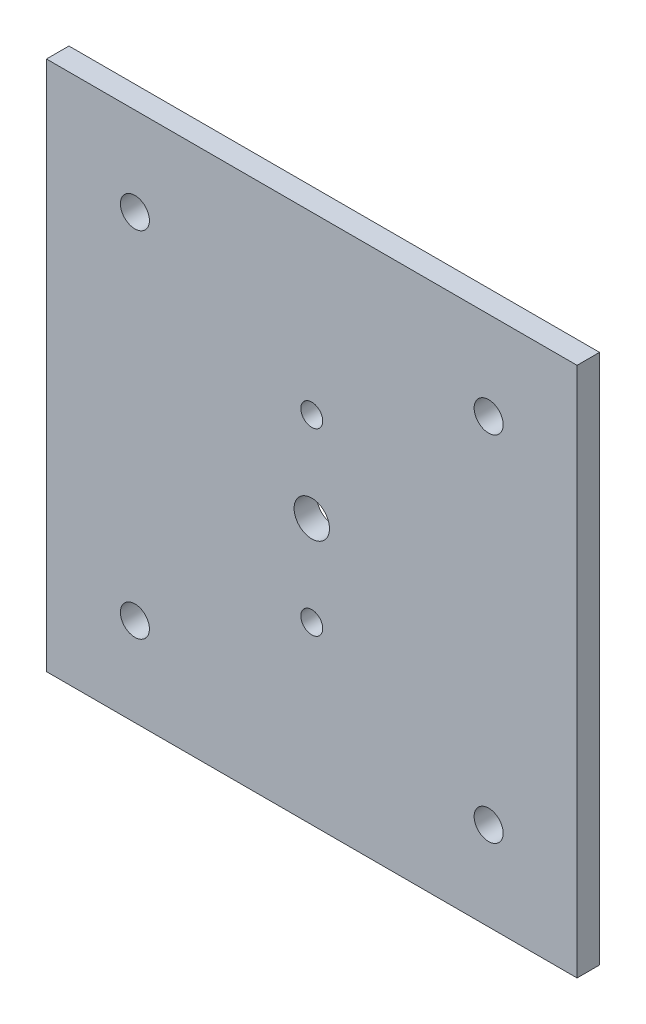
ISO-10303-21;
HEADER;
FILE_DESCRIPTION(('STEP AP214'),'2;1');
FILE_NAME('part.step','',(''),(''),'','','');
FILE_SCHEMA(('AUTOMOTIVE_DESIGN { 1 0 10303 214 1 1 1 1 }'));
ENDSEC;
DATA;
#1=APPLICATION_CONTEXT('core data for automotive mechanical design processes');
#2=APPLICATION_PROTOCOL_DEFINITION('international standard','automotive_design',2000,#1);
#3=PRODUCT_CONTEXT('',#1,'mechanical');
#4=PRODUCT('Part','Part','',(#3));
#5=PRODUCT_RELATED_PRODUCT_CATEGORY('part','',(#4));
#6=PRODUCT_DEFINITION_FORMATION('','',#4);
#7=PRODUCT_DEFINITION_CONTEXT('part definition',#1,'design');
#8=PRODUCT_DEFINITION('design','',#6,#7);
#9=PRODUCT_DEFINITION_SHAPE('','',#8);
#10=(LENGTH_UNIT() NAMED_UNIT(*) SI_UNIT(.MILLI.,.METRE.));
#11=(NAMED_UNIT(*) PLANE_ANGLE_UNIT() SI_UNIT($,.RADIAN.));
#12=(NAMED_UNIT(*) SI_UNIT($,.STERADIAN.) SOLID_ANGLE_UNIT());
#13=UNCERTAINTY_MEASURE_WITH_UNIT(LENGTH_MEASURE(1.E-05),#10,'distance_accuracy_value','');
#14=(GEOMETRIC_REPRESENTATION_CONTEXT(3) GLOBAL_UNCERTAINTY_ASSIGNED_CONTEXT((#13)) GLOBAL_UNIT_ASSIGNED_CONTEXT((#10,
#11,#12)) REPRESENTATION_CONTEXT('',''));
#15=CARTESIAN_POINT('',(0.,0.,0.));
#16=DIRECTION('',(0.,0.,1.));
#17=DIRECTION('',(1.,0.,0.));
#18=AXIS2_PLACEMENT_3D('',#15,#16,#17);
#19=CARTESIAN_POINT('',(0.,0.,6.35));
#20=DIRECTION('',(0.,0.,1.));
#21=DIRECTION('',(1.,0.,0.));
#22=AXIS2_PLACEMENT_3D('',#19,#20,#21);
#23=PLANE('',#22);
#24=CARTESIAN_POINT('',(-50.,-50.,6.35));
#25=DIRECTION('',(0.,0.,1.));
#26=DIRECTION('',(1.,0.,0.));
#27=AXIS2_PLACEMENT_3D('',#24,#25,#26);
#28=CIRCLE('',#27,4.1);
#29=CARTESIAN_POINT('',(-45.9,-50.,6.35));
#30=VERTEX_POINT('',#29);
#31=EDGE_CURVE('E141',#30,#30,#28,.T.);
#32=ORIENTED_EDGE('',*,*,#31,.F.);
#33=EDGE_LOOP('',(#32));
#34=FACE_BOUND('',#33,.T.);
#35=CARTESIAN_POINT('',(50.,50.,6.35));
#36=DIRECTION('',(0.,0.,1.));
#37=DIRECTION('',(1.,0.,0.));
#38=AXIS2_PLACEMENT_3D('',#35,#36,#37);
#39=CIRCLE('',#38,4.1);
#40=CARTESIAN_POINT('',(54.1,50.,6.35));
#41=VERTEX_POINT('',#40);
#42=EDGE_CURVE('E129',#41,#41,#39,.T.);
#43=ORIENTED_EDGE('',*,*,#42,.F.);
#44=EDGE_LOOP('',(#43));
#45=FACE_BOUND('',#44,.T.);
#46=CARTESIAN_POINT('',(0.,-25.4,6.35));
#47=DIRECTION('',(0.,0.,1.));
#48=DIRECTION('',(1.,0.,0.));
#49=AXIS2_PLACEMENT_3D('',#46,#47,#48);
#50=CIRCLE('',#49,3.1);
#51=CARTESIAN_POINT('',(3.10000000000001,-25.4,6.35));
#52=VERTEX_POINT('',#51);
#53=EDGE_CURVE('E117',#52,#52,#50,.T.);
#54=ORIENTED_EDGE('',*,*,#53,.F.);
#55=EDGE_LOOP('',(#54));
#56=FACE_BOUND('',#55,.T.);
#57=DIRECTION('',(0.,1.,0.));
#58=VECTOR('',#57,1.);
#59=CARTESIAN_POINT('',(75.,75.,6.35));
#60=LINE('',#59,#58);
#61=CARTESIAN_POINT('',(75.,-75.,6.35));
#62=VERTEX_POINT('',#61);
#63=CARTESIAN_POINT('',(75.,75.,6.35));
#64=VERTEX_POINT('',#63);
#65=EDGE_CURVE('E87',#62,#64,#60,.T.);
#66=ORIENTED_EDGE('',*,*,#65,.T.);
#67=DIRECTION('',(-1.,0.,0.));
#68=VECTOR('',#67,1.);
#69=CARTESIAN_POINT('',(-75.,75.,6.35));
#70=LINE('',#69,#68);
#71=CARTESIAN_POINT('',(-75.,75.,6.35));
#72=VERTEX_POINT('',#71);
#73=EDGE_CURVE('E82',#64,#72,#70,.T.);
#74=ORIENTED_EDGE('',*,*,#73,.T.);
#75=DIRECTION('',(0.,-1.,0.));
#76=VECTOR('',#75,1.);
#77=CARTESIAN_POINT('',(-75.,75.,6.35));
#78=LINE('',#77,#76);
#79=CARTESIAN_POINT('',(-75.,-75.,6.35));
#80=VERTEX_POINT('',#79);
#81=EDGE_CURVE('E85',#72,#80,#78,.T.);
#82=ORIENTED_EDGE('',*,*,#81,.T.);
#83=DIRECTION('',(1.,0.,0.));
#84=VECTOR('',#83,1.);
#85=CARTESIAN_POINT('',(-75.,-75.,6.35));
#86=LINE('',#85,#84);
#87=EDGE_CURVE('E52',#80,#62,#86,.T.);
#88=ORIENTED_EDGE('',*,*,#87,.T.);
#89=EDGE_LOOP('',(#66,#74,#82,#88));
#90=FACE_BOUND('',#89,.T.);
#91=CARTESIAN_POINT('',(0.,25.4,6.35));
#92=DIRECTION('',(0.,0.,1.));
#93=DIRECTION('',(1.,0.,0.));
#94=AXIS2_PLACEMENT_3D('',#91,#92,#93);
#95=CIRCLE('',#94,3.1);
#96=CARTESIAN_POINT('',(3.1,25.4,6.35));
#97=VERTEX_POINT('',#96);
#98=EDGE_CURVE('E102',#97,#97,#95,.T.);
#99=ORIENTED_EDGE('',*,*,#98,.F.);
#100=EDGE_LOOP('',(#99));
#101=FACE_BOUND('',#100,.T.);
#102=CARTESIAN_POINT('',(-50.,50.,6.35));
#103=DIRECTION('',(0.,0.,1.));
#104=DIRECTION('',(1.,0.,0.));
#105=AXIS2_PLACEMENT_3D('',#102,#103,#104);
#106=CIRCLE('',#105,4.1);
#107=CARTESIAN_POINT('',(-45.9,50.,6.35));
#108=VERTEX_POINT('',#107);
#109=EDGE_CURVE('E123',#108,#108,#106,.T.);
#110=ORIENTED_EDGE('',*,*,#109,.F.);
#111=EDGE_LOOP('',(#110));
#112=FACE_BOUND('',#111,.T.);
#113=CARTESIAN_POINT('',(50.,-50.,6.35));
#114=DIRECTION('',(0.,0.,1.));
#115=DIRECTION('',(1.,0.,0.));
#116=AXIS2_PLACEMENT_3D('',#113,#114,#115);
#117=CIRCLE('',#116,4.1);
#118=CARTESIAN_POINT('',(54.1,-50.,6.35));
#119=VERTEX_POINT('',#118);
#120=EDGE_CURVE('E135',#119,#119,#117,.T.);
#121=ORIENTED_EDGE('',*,*,#120,.F.);
#122=EDGE_LOOP('',(#121));
#123=FACE_BOUND('',#122,.T.);
#124=CARTESIAN_POINT('',(0.,0.,6.35));
#125=DIRECTION('',(0.,0.,1.));
#126=DIRECTION('',(1.,0.,0.));
#127=AXIS2_PLACEMENT_3D('',#124,#125,#126);
#128=CIRCLE('',#127,5.);
#129=CARTESIAN_POINT('',(5.,0.,6.35));
#130=VERTEX_POINT('',#129);
#131=EDGE_CURVE('E147',#130,#130,#128,.T.);
#132=ORIENTED_EDGE('',*,*,#131,.F.);
#133=EDGE_LOOP('',(#132));
#134=FACE_BOUND('',#133,.T.);
#135=ADVANCED_FACE('F35',(#34,#45,#56,#90,#101,#112,#123,#134),#23,.T.);
#136=CARTESIAN_POINT('',(0.,0.,0.));
#137=DIRECTION('',(0.,0.,1.));
#138=DIRECTION('',(1.,0.,0.));
#139=AXIS2_PLACEMENT_3D('',#136,#137,#138);
#140=PLANE('',#139);
#141=DIRECTION('',(0.,1.,0.));
#142=VECTOR('',#141,1.);
#143=CARTESIAN_POINT('',(75.,75.,0.));
#144=LINE('',#143,#142);
#145=CARTESIAN_POINT('',(75.,-75.,0.));
#146=VERTEX_POINT('',#145);
#147=CARTESIAN_POINT('',(75.,75.,0.));
#148=VERTEX_POINT('',#147);
#149=EDGE_CURVE('E99',#146,#148,#144,.T.);
#150=ORIENTED_EDGE('',*,*,#149,.F.);
#151=DIRECTION('',(1.,0.,0.));
#152=VECTOR('',#151,1.);
#153=CARTESIAN_POINT('',(-75.,-75.,0.));
#154=LINE('',#153,#152);
#155=CARTESIAN_POINT('',(-75.,-75.,0.));
#156=VERTEX_POINT('',#155);
#157=EDGE_CURVE('E75',#156,#146,#154,.T.);
#158=ORIENTED_EDGE('',*,*,#157,.F.);
#159=DIRECTION('',(0.,-1.,0.));
#160=VECTOR('',#159,1.);
#161=CARTESIAN_POINT('',(-75.,75.,0.));
#162=LINE('',#161,#160);
#163=CARTESIAN_POINT('',(-75.,75.,0.));
#164=VERTEX_POINT('',#163);
#165=EDGE_CURVE('E69',#164,#156,#162,.T.);
#166=ORIENTED_EDGE('',*,*,#165,.F.);
#167=DIRECTION('',(-1.,0.,0.));
#168=VECTOR('',#167,1.);
#169=CARTESIAN_POINT('',(-75.,75.,0.));
#170=LINE('',#169,#168);
#171=EDGE_CURVE('E91',#148,#164,#170,.T.);
#172=ORIENTED_EDGE('',*,*,#171,.F.);
#173=EDGE_LOOP('',(#150,#158,#166,#172));
#174=FACE_BOUND('',#173,.T.);
#175=CARTESIAN_POINT('',(0.,25.4,0.));
#176=DIRECTION('',(0.,0.,1.));
#177=DIRECTION('',(1.,0.,0.));
#178=AXIS2_PLACEMENT_3D('',#175,#176,#177);
#179=CIRCLE('',#178,3.1);
#180=CARTESIAN_POINT('',(3.1,25.4,0.));
#181=VERTEX_POINT('',#180);
#182=EDGE_CURVE('E114',#181,#181,#179,.T.);
#183=ORIENTED_EDGE('',*,*,#182,.T.);
#184=EDGE_LOOP('',(#183));
#185=FACE_BOUND('',#184,.T.);
#186=CARTESIAN_POINT('',(0.,-25.4,0.));
#187=DIRECTION('',(0.,0.,1.));
#188=DIRECTION('',(1.,0.,0.));
#189=AXIS2_PLACEMENT_3D('',#186,#187,#188);
#190=CIRCLE('',#189,3.1);
#191=CARTESIAN_POINT('',(3.10000000000001,-25.4,0.));
#192=VERTEX_POINT('',#191);
#193=EDGE_CURVE('E120',#192,#192,#190,.T.);
#194=ORIENTED_EDGE('',*,*,#193,.T.);
#195=EDGE_LOOP('',(#194));
#196=FACE_BOUND('',#195,.T.);
#197=CARTESIAN_POINT('',(-50.,50.,0.));
#198=DIRECTION('',(0.,0.,1.));
#199=DIRECTION('',(1.,0.,0.));
#200=AXIS2_PLACEMENT_3D('',#197,#198,#199);
#201=CIRCLE('',#200,4.1);
#202=CARTESIAN_POINT('',(-45.9,50.,0.));
#203=VERTEX_POINT('',#202);
#204=EDGE_CURVE('E126',#203,#203,#201,.T.);
#205=ORIENTED_EDGE('',*,*,#204,.T.);
#206=EDGE_LOOP('',(#205));
#207=FACE_BOUND('',#206,.T.);
#208=CARTESIAN_POINT('',(50.,50.,0.));
#209=DIRECTION('',(0.,0.,1.));
#210=DIRECTION('',(1.,0.,0.));
#211=AXIS2_PLACEMENT_3D('',#208,#209,#210);
#212=CIRCLE('',#211,4.1);
#213=CARTESIAN_POINT('',(54.1,50.,0.));
#214=VERTEX_POINT('',#213);
#215=EDGE_CURVE('E132',#214,#214,#212,.T.);
#216=ORIENTED_EDGE('',*,*,#215,.T.);
#217=EDGE_LOOP('',(#216));
#218=FACE_BOUND('',#217,.T.);
#219=CARTESIAN_POINT('',(50.,-50.,0.));
#220=DIRECTION('',(0.,0.,1.));
#221=DIRECTION('',(1.,0.,0.));
#222=AXIS2_PLACEMENT_3D('',#219,#220,#221);
#223=CIRCLE('',#222,4.1);
#224=CARTESIAN_POINT('',(54.1,-50.,0.));
#225=VERTEX_POINT('',#224);
#226=EDGE_CURVE('E138',#225,#225,#223,.T.);
#227=ORIENTED_EDGE('',*,*,#226,.T.);
#228=EDGE_LOOP('',(#227));
#229=FACE_BOUND('',#228,.T.);
#230=CARTESIAN_POINT('',(-50.,-50.,0.));
#231=DIRECTION('',(0.,0.,1.));
#232=DIRECTION('',(1.,0.,0.));
#233=AXIS2_PLACEMENT_3D('',#230,#231,#232);
#234=CIRCLE('',#233,4.1);
#235=CARTESIAN_POINT('',(-45.9,-50.,0.));
#236=VERTEX_POINT('',#235);
#237=EDGE_CURVE('E144',#236,#236,#234,.T.);
#238=ORIENTED_EDGE('',*,*,#237,.T.);
#239=EDGE_LOOP('',(#238));
#240=FACE_BOUND('',#239,.T.);
#241=CARTESIAN_POINT('',(0.,0.,0.));
#242=DIRECTION('',(0.,0.,1.));
#243=DIRECTION('',(1.,0.,0.));
#244=AXIS2_PLACEMENT_3D('',#241,#242,#243);
#245=CIRCLE('',#244,5.);
#246=CARTESIAN_POINT('',(5.,0.,0.));
#247=VERTEX_POINT('',#246);
#248=EDGE_CURVE('E150',#247,#247,#245,.T.);
#249=ORIENTED_EDGE('',*,*,#248,.T.);
#250=EDGE_LOOP('',(#249));
#251=FACE_BOUND('',#250,.T.);
#252=ADVANCED_FACE('F110',(#174,#185,#196,#207,#218,#229,#240,#251),#140,.F.);
#253=CARTESIAN_POINT('',(75.,75.,6.35));
#254=DIRECTION('',(-1.,0.,0.));
#255=DIRECTION('',(0.,-1.,0.));
#256=AXIS2_PLACEMENT_3D('',#253,#254,#255);
#257=PLANE('',#256);
#258=ORIENTED_EDGE('',*,*,#149,.T.);
#259=DIRECTION('',(0.,0.,-1.));
#260=VECTOR('',#259,1.);
#261=CARTESIAN_POINT('',(75.,75.,6.35));
#262=LINE('',#261,#260);
#263=EDGE_CURVE('E11',#64,#148,#262,.T.);
#264=ORIENTED_EDGE('',*,*,#263,.F.);
#265=ORIENTED_EDGE('',*,*,#65,.F.);
#266=DIRECTION('',(0.,0.,-1.));
#267=VECTOR('',#266,1.);
#268=CARTESIAN_POINT('',(75.,-75.,6.35));
#269=LINE('',#268,#267);
#270=EDGE_CURVE('E95',#62,#146,#269,.T.);
#271=ORIENTED_EDGE('',*,*,#270,.T.);
#272=EDGE_LOOP('',(#258,#264,#265,#271));
#273=FACE_BOUND('',#272,.T.);
#274=ADVANCED_FACE('F37',(#273),#257,.F.);
#275=CARTESIAN_POINT('',(-75.,75.,6.35));
#276=DIRECTION('',(0.,-1.,0.));
#277=DIRECTION('',(0.,0.,-1.));
#278=AXIS2_PLACEMENT_3D('',#275,#276,#277);
#279=PLANE('',#278);
#280=ORIENTED_EDGE('',*,*,#171,.T.);
#281=DIRECTION('',(0.,0.,-1.));
#282=VECTOR('',#281,1.);
#283=CARTESIAN_POINT('',(-75.,75.,6.35));
#284=LINE('',#283,#282);
#285=EDGE_CURVE('E44',#72,#164,#284,.T.);
#286=ORIENTED_EDGE('',*,*,#285,.F.);
#287=ORIENTED_EDGE('',*,*,#73,.F.);
#288=ORIENTED_EDGE('',*,*,#263,.T.);
#289=EDGE_LOOP('',(#280,#286,#287,#288));
#290=FACE_BOUND('',#289,.T.);
#291=ADVANCED_FACE('F90',(#290),#279,.F.);
#292=CARTESIAN_POINT('',(-75.,75.,6.35));
#293=DIRECTION('',(1.,0.,0.));
#294=DIRECTION('',(0.,0.,-1.));
#295=AXIS2_PLACEMENT_3D('',#292,#293,#294);
#296=PLANE('',#295);
#297=ORIENTED_EDGE('',*,*,#165,.T.);
#298=DIRECTION('',(0.,0.,-1.));
#299=VECTOR('',#298,1.);
#300=CARTESIAN_POINT('',(-75.,-75.,6.35));
#301=LINE('',#300,#299);
#302=EDGE_CURVE('E92',#80,#156,#301,.T.);
#303=ORIENTED_EDGE('',*,*,#302,.F.);
#304=ORIENTED_EDGE('',*,*,#81,.F.);
#305=ORIENTED_EDGE('',*,*,#285,.T.);
#306=EDGE_LOOP('',(#297,#303,#304,#305));
#307=FACE_BOUND('',#306,.T.);
#308=ADVANCED_FACE('F93',(#307),#296,.F.);
#309=CARTESIAN_POINT('',(-75.,-75.,6.35));
#310=DIRECTION('',(0.,1.,0.));
#311=DIRECTION('',(0.,0.,1.));
#312=AXIS2_PLACEMENT_3D('',#309,#310,#311);
#313=PLANE('',#312);
#314=ORIENTED_EDGE('',*,*,#157,.T.);
#315=ORIENTED_EDGE('',*,*,#270,.F.);
#316=ORIENTED_EDGE('',*,*,#87,.F.);
#317=ORIENTED_EDGE('',*,*,#302,.T.);
#318=EDGE_LOOP('',(#314,#315,#316,#317));
#319=FACE_BOUND('',#318,.T.);
#320=ADVANCED_FACE('F107',(#319),#313,.F.);
#321=CARTESIAN_POINT('',(0.,25.4,6.35));
#322=DIRECTION('',(0.,0.,-1.));
#323=DIRECTION('',(-1.,0.,0.));
#324=AXIS2_PLACEMENT_3D('',#321,#322,#323);
#325=CYLINDRICAL_SURFACE('',#324,3.1);
#326=ORIENTED_EDGE('',*,*,#98,.T.);
#327=EDGE_LOOP('',(#326));
#328=FACE_BOUND('',#327,.T.);
#329=ORIENTED_EDGE('',*,*,#182,.F.);
#330=EDGE_LOOP('',(#329));
#331=FACE_BOUND('',#330,.T.);
#332=ADVANCED_FACE('F169',(#328,#331),#325,.F.);
#333=CARTESIAN_POINT('',(0.,-25.4,6.35));
#334=DIRECTION('',(0.,0.,-1.));
#335=DIRECTION('',(-1.,0.,0.));
#336=AXIS2_PLACEMENT_3D('',#333,#334,#335);
#337=CYLINDRICAL_SURFACE('',#336,3.1);
#338=ORIENTED_EDGE('',*,*,#53,.T.);
#339=EDGE_LOOP('',(#338));
#340=FACE_BOUND('',#339,.T.);
#341=ORIENTED_EDGE('',*,*,#193,.F.);
#342=EDGE_LOOP('',(#341));
#343=FACE_BOUND('',#342,.T.);
#344=ADVANCED_FACE('F215',(#340,#343),#337,.F.);
#345=CARTESIAN_POINT('',(-50.,50.,6.35));
#346=DIRECTION('',(0.,0.,-1.));
#347=DIRECTION('',(-1.,0.,0.));
#348=AXIS2_PLACEMENT_3D('',#345,#346,#347);
#349=CYLINDRICAL_SURFACE('',#348,4.1);
#350=ORIENTED_EDGE('',*,*,#109,.T.);
#351=EDGE_LOOP('',(#350));
#352=FACE_BOUND('',#351,.T.);
#353=ORIENTED_EDGE('',*,*,#204,.F.);
#354=EDGE_LOOP('',(#353));
#355=FACE_BOUND('',#354,.T.);
#356=ADVANCED_FACE('F223',(#352,#355),#349,.F.);
#357=CARTESIAN_POINT('',(50.,50.,6.35));
#358=DIRECTION('',(0.,0.,-1.));
#359=DIRECTION('',(-1.,0.,0.));
#360=AXIS2_PLACEMENT_3D('',#357,#358,#359);
#361=CYLINDRICAL_SURFACE('',#360,4.1);
#362=ORIENTED_EDGE('',*,*,#42,.T.);
#363=EDGE_LOOP('',(#362));
#364=FACE_BOUND('',#363,.T.);
#365=ORIENTED_EDGE('',*,*,#215,.F.);
#366=EDGE_LOOP('',(#365));
#367=FACE_BOUND('',#366,.T.);
#368=ADVANCED_FACE('F231',(#364,#367),#361,.F.);
#369=CARTESIAN_POINT('',(50.,-50.,6.35));
#370=DIRECTION('',(0.,0.,-1.));
#371=DIRECTION('',(-1.,0.,0.));
#372=AXIS2_PLACEMENT_3D('',#369,#370,#371);
#373=CYLINDRICAL_SURFACE('',#372,4.1);
#374=ORIENTED_EDGE('',*,*,#120,.T.);
#375=EDGE_LOOP('',(#374));
#376=FACE_BOUND('',#375,.T.);
#377=ORIENTED_EDGE('',*,*,#226,.F.);
#378=EDGE_LOOP('',(#377));
#379=FACE_BOUND('',#378,.T.);
#380=ADVANCED_FACE('F240',(#376,#379),#373,.F.);
#381=CARTESIAN_POINT('',(-50.,-50.,6.35));
#382=DIRECTION('',(0.,0.,-1.));
#383=DIRECTION('',(-1.,0.,0.));
#384=AXIS2_PLACEMENT_3D('',#381,#382,#383);
#385=CYLINDRICAL_SURFACE('',#384,4.1);
#386=ORIENTED_EDGE('',*,*,#31,.T.);
#387=EDGE_LOOP('',(#386));
#388=FACE_BOUND('',#387,.T.);
#389=ORIENTED_EDGE('',*,*,#237,.F.);
#390=EDGE_LOOP('',(#389));
#391=FACE_BOUND('',#390,.T.);
#392=ADVANCED_FACE('F249',(#388,#391),#385,.F.);
#393=CARTESIAN_POINT('',(0.,0.,6.35));
#394=DIRECTION('',(0.,0.,-1.));
#395=DIRECTION('',(-1.,0.,0.));
#396=AXIS2_PLACEMENT_3D('',#393,#394,#395);
#397=CYLINDRICAL_SURFACE('',#396,5.);
#398=ORIENTED_EDGE('',*,*,#131,.T.);
#399=EDGE_LOOP('',(#398));
#400=FACE_BOUND('',#399,.T.);
#401=ORIENTED_EDGE('',*,*,#248,.F.);
#402=EDGE_LOOP('',(#401));
#403=FACE_BOUND('',#402,.T.);
#404=ADVANCED_FACE('F156',(#400,#403),#397,.F.);
#405=CLOSED_SHELL('',(#135,#252,#274,#291,#308,#320,#332,#344,#356,#368,#380,#392,#404));
#406=MANIFOLD_SOLID_BREP('B2',#405);
#407=ADVANCED_BREP_SHAPE_REPRESENTATION('',(#18,#406),#14);
#408=SHAPE_DEFINITION_REPRESENTATION(#9,#407);
ENDSEC;
END-ISO-10303-21;
